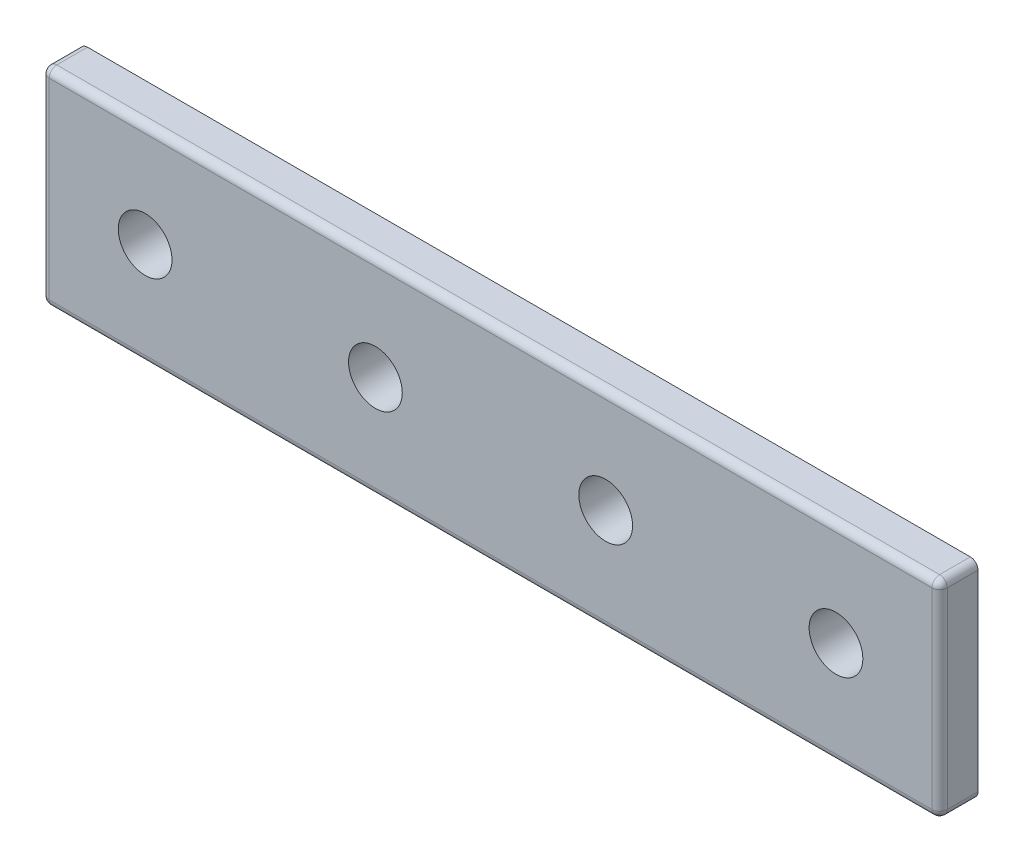
ISO-10303-21;
HEADER;
FILE_DESCRIPTION(('STEP AP214'),'2;1');
FILE_NAME('part.step','',(''),(''),'','','');
FILE_SCHEMA(('AUTOMOTIVE_DESIGN { 1 0 10303 214 1 1 1 1 }'));
ENDSEC;
DATA;
#1=APPLICATION_CONTEXT('core data for automotive mechanical design processes');
#2=APPLICATION_PROTOCOL_DEFINITION('international standard','automotive_design',2000,#1);
#3=PRODUCT_CONTEXT('',#1,'mechanical');
#4=PRODUCT('Part','Part','',(#3));
#5=PRODUCT_RELATED_PRODUCT_CATEGORY('part','',(#4));
#6=PRODUCT_DEFINITION_FORMATION('','',#4);
#7=PRODUCT_DEFINITION_CONTEXT('part definition',#1,'design');
#8=PRODUCT_DEFINITION('design','',#6,#7);
#9=PRODUCT_DEFINITION_SHAPE('','',#8);
#10=(LENGTH_UNIT() NAMED_UNIT(*) SI_UNIT(.MILLI.,.METRE.));
#11=(NAMED_UNIT(*) PLANE_ANGLE_UNIT() SI_UNIT($,.RADIAN.));
#12=(NAMED_UNIT(*) SI_UNIT($,.STERADIAN.) SOLID_ANGLE_UNIT());
#13=UNCERTAINTY_MEASURE_WITH_UNIT(LENGTH_MEASURE(1.E-05),#10,'distance_accuracy_value','');
#14=(GEOMETRIC_REPRESENTATION_CONTEXT(3) GLOBAL_UNCERTAINTY_ASSIGNED_CONTEXT((#13)) GLOBAL_UNIT_ASSIGNED_CONTEXT((#10,
#11,#12)) REPRESENTATION_CONTEXT('',''));
#15=CARTESIAN_POINT('',(0.,0.,0.));
#16=DIRECTION('',(0.,0.,1.));
#17=DIRECTION('',(1.,0.,0.));
#18=AXIS2_PLACEMENT_3D('',#15,#16,#17);
#19=CARTESIAN_POINT('',(0.,0.,2.5));
#20=DIRECTION('',(0.,0.,-1.));
#21=DIRECTION('',(-1.,0.,0.));
#22=AXIS2_PLACEMENT_3D('',#19,#20,#21);
#23=PLANE('',#22);
#24=DIRECTION('',(-1.,0.,0.));
#25=VECTOR('',#24,1.);
#26=CARTESIAN_POINT('',(0.,26.,2.5));
#27=LINE('',#26,#25);
#28=CARTESIAN_POINT('',(116.,26.,2.5));
#29=VERTEX_POINT('',#28);
#30=CARTESIAN_POINT('',(1.,26.,2.5));
#31=VERTEX_POINT('',#30);
#32=EDGE_CURVE('E160',#29,#31,#27,.T.);
#33=ORIENTED_EDGE('',*,*,#32,.T.);
#34=DIRECTION('',(0.,-1.,0.));
#35=VECTOR('',#34,1.);
#36=CARTESIAN_POINT('',(1.,0.,2.5));
#37=LINE('',#36,#35);
#38=CARTESIAN_POINT('',(1.,1.,2.5));
#39=VERTEX_POINT('',#38);
#40=EDGE_CURVE('E166',#31,#39,#37,.T.);
#41=ORIENTED_EDGE('',*,*,#40,.T.);
#42=DIRECTION('',(1.,0.,0.));
#43=VECTOR('',#42,1.);
#44=CARTESIAN_POINT('',(0.,1.,2.5));
#45=LINE('',#44,#43);
#46=CARTESIAN_POINT('',(116.,1.,2.5));
#47=VERTEX_POINT('',#46);
#48=EDGE_CURVE('E164',#39,#47,#45,.T.);
#49=ORIENTED_EDGE('',*,*,#48,.T.);
#50=DIRECTION('',(0.,1.,0.));
#51=VECTOR('',#50,1.);
#52=CARTESIAN_POINT('',(116.,0.,2.5));
#53=LINE('',#52,#51);
#54=EDGE_CURVE('E162',#47,#29,#53,.T.);
#55=ORIENTED_EDGE('',*,*,#54,.T.);
#56=EDGE_LOOP('',(#33,#41,#49,#55));
#57=FACE_BOUND('',#56,.T.);
#58=CARTESIAN_POINT('',(73.5,13.5,2.5));
#59=DIRECTION('',(0.,0.,1.));
#60=DIRECTION('',(1.,0.,0.));
#61=AXIS2_PLACEMENT_3D('',#58,#59,#60);
#62=CIRCLE('',#61,3.50000000000001);
#63=CARTESIAN_POINT('',(77.,13.5,2.5));
#64=VERTEX_POINT('',#63);
#65=EDGE_CURVE('E223',#64,#64,#62,.T.);
#66=ORIENTED_EDGE('',*,*,#65,.F.);
#67=EDGE_LOOP('',(#66));
#68=FACE_BOUND('',#67,.T.);
#69=CARTESIAN_POINT('',(13.5,13.5,2.5));
#70=DIRECTION('',(0.,0.,1.));
#71=DIRECTION('',(1.,0.,0.));
#72=AXIS2_PLACEMENT_3D('',#69,#70,#71);
#73=CIRCLE('',#72,3.5);
#74=CARTESIAN_POINT('',(17.,13.5,2.5));
#75=VERTEX_POINT('',#74);
#76=EDGE_CURVE('E136',#75,#75,#73,.T.);
#77=ORIENTED_EDGE('',*,*,#76,.F.);
#78=EDGE_LOOP('',(#77));
#79=FACE_BOUND('',#78,.T.);
#80=CARTESIAN_POINT('',(43.5,13.5,2.5));
#81=DIRECTION('',(0.,0.,1.));
#82=DIRECTION('',(1.,0.,0.));
#83=AXIS2_PLACEMENT_3D('',#80,#81,#82);
#84=CIRCLE('',#83,3.5);
#85=CARTESIAN_POINT('',(47.,13.5,2.5));
#86=VERTEX_POINT('',#85);
#87=EDGE_CURVE('E229',#86,#86,#84,.T.);
#88=ORIENTED_EDGE('',*,*,#87,.F.);
#89=EDGE_LOOP('',(#88));
#90=FACE_BOUND('',#89,.T.);
#91=CARTESIAN_POINT('',(103.5,13.5,2.5));
#92=DIRECTION('',(0.,0.,1.));
#93=DIRECTION('',(1.,0.,0.));
#94=AXIS2_PLACEMENT_3D('',#91,#92,#93);
#95=CIRCLE('',#94,3.50000000000001);
#96=CARTESIAN_POINT('',(107.,13.5,2.5));
#97=VERTEX_POINT('',#96);
#98=EDGE_CURVE('E215',#97,#97,#95,.T.);
#99=ORIENTED_EDGE('',*,*,#98,.F.);
#100=EDGE_LOOP('',(#99));
#101=FACE_BOUND('',#100,.T.);
#102=ADVANCED_FACE('F32',(#57,#68,#79,#90,#101),#23,.F.);
#103=CARTESIAN_POINT('',(0.,0.,-2.5));
#104=DIRECTION('',(0.,0.,-1.));
#105=DIRECTION('',(-1.,0.,0.));
#106=AXIS2_PLACEMENT_3D('',#103,#104,#105);
#107=PLANE('',#106);
#108=CARTESIAN_POINT('',(73.5,13.5,-2.5));
#109=DIRECTION('',(0.,0.,1.));
#110=DIRECTION('',(1.,0.,0.));
#111=AXIS2_PLACEMENT_3D('',#108,#109,#110);
#112=CIRCLE('',#111,3.50000000000001);
#113=CARTESIAN_POINT('',(77.,13.5,-2.5));
#114=VERTEX_POINT('',#113);
#115=EDGE_CURVE('E220',#114,#114,#112,.T.);
#116=ORIENTED_EDGE('',*,*,#115,.T.);
#117=EDGE_LOOP('',(#116));
#118=FACE_BOUND('',#117,.T.);
#119=CARTESIAN_POINT('',(13.5,13.5,-2.5));
#120=DIRECTION('',(0.,0.,1.));
#121=DIRECTION('',(1.,0.,0.));
#122=AXIS2_PLACEMENT_3D('',#119,#120,#121);
#123=CIRCLE('',#122,3.5);
#124=CARTESIAN_POINT('',(17.,13.5,-2.5));
#125=VERTEX_POINT('',#124);
#126=EDGE_CURVE('E142',#125,#125,#123,.T.);
#127=ORIENTED_EDGE('',*,*,#126,.T.);
#128=EDGE_LOOP('',(#127));
#129=FACE_BOUND('',#128,.T.);
#130=DIRECTION('',(1.,0.,0.));
#131=VECTOR('',#130,1.);
#132=CARTESIAN_POINT('',(117.,0.,-2.5));
#133=LINE('',#132,#131);
#134=CARTESIAN_POINT('',(1.,0.,-2.5));
#135=VERTEX_POINT('',#134);
#136=CARTESIAN_POINT('',(116.,0.,-2.5));
#137=VERTEX_POINT('',#136);
#138=EDGE_CURVE('E124',#135,#137,#133,.T.);
#139=ORIENTED_EDGE('',*,*,#138,.F.);
#140=CARTESIAN_POINT('',(1.,1.,-2.5));
#141=DIRECTION('',(0.,0.,-1.));
#142=DIRECTION('',(-1.,0.,0.));
#143=AXIS2_PLACEMENT_3D('',#140,#141,#142);
#144=CIRCLE('',#143,1.);
#145=CARTESIAN_POINT('',(0.,1.,-2.5));
#146=VERTEX_POINT('',#145);
#147=EDGE_CURVE('E108',#135,#146,#144,.T.);
#148=ORIENTED_EDGE('',*,*,#147,.T.);
#149=DIRECTION('',(0.,-1.,0.));
#150=VECTOR('',#149,1.);
#151=CARTESIAN_POINT('',(0.,0.,-2.5));
#152=LINE('',#151,#150);
#153=CARTESIAN_POINT('',(0.,26.,-2.5));
#154=VERTEX_POINT('',#153);
#155=EDGE_CURVE('E147',#154,#146,#152,.T.);
#156=ORIENTED_EDGE('',*,*,#155,.F.);
#157=CARTESIAN_POINT('',(1.,26.,-2.5));
#158=DIRECTION('',(0.,0.,-1.));
#159=DIRECTION('',(-1.,0.,0.));
#160=AXIS2_PLACEMENT_3D('',#157,#158,#159);
#161=CIRCLE('',#160,1.);
#162=CARTESIAN_POINT('',(1.,27.,-2.5));
#163=VERTEX_POINT('',#162);
#164=EDGE_CURVE('E129',#154,#163,#161,.T.);
#165=ORIENTED_EDGE('',*,*,#164,.T.);
#166=DIRECTION('',(-1.,0.,0.));
#167=VECTOR('',#166,1.);
#168=CARTESIAN_POINT('',(117.,27.,-2.5));
#169=LINE('',#168,#167);
#170=CARTESIAN_POINT('',(116.,27.,-2.5));
#171=VERTEX_POINT('',#170);
#172=EDGE_CURVE('E139',#171,#163,#169,.T.);
#173=ORIENTED_EDGE('',*,*,#172,.F.);
#174=CARTESIAN_POINT('',(116.,26.,-2.5));
#175=DIRECTION('',(0.,0.,-1.));
#176=DIRECTION('',(-1.,0.,0.));
#177=AXIS2_PLACEMENT_3D('',#174,#175,#176);
#178=CIRCLE('',#177,1.);
#179=CARTESIAN_POINT('',(117.,26.,-2.5));
#180=VERTEX_POINT('',#179);
#181=EDGE_CURVE('E153',#171,#180,#178,.T.);
#182=ORIENTED_EDGE('',*,*,#181,.T.);
#183=DIRECTION('',(0.,1.,0.));
#184=VECTOR('',#183,1.);
#185=CARTESIAN_POINT('',(117.,27.,-2.5));
#186=LINE('',#185,#184);
#187=CARTESIAN_POINT('',(117.,1.,-2.5));
#188=VERTEX_POINT('',#187);
#189=EDGE_CURVE('E135',#188,#180,#186,.T.);
#190=ORIENTED_EDGE('',*,*,#189,.F.);
#191=CARTESIAN_POINT('',(116.,1.,-2.5));
#192=DIRECTION('',(0.,0.,-1.));
#193=DIRECTION('',(-1.,0.,0.));
#194=AXIS2_PLACEMENT_3D('',#191,#192,#193);
#195=CIRCLE('',#194,1.);
#196=EDGE_CURVE('E119',#188,#137,#195,.T.);
#197=ORIENTED_EDGE('',*,*,#196,.T.);
#198=EDGE_LOOP('',(#139,#148,#156,#165,#173,#182,#190,#197));
#199=FACE_BOUND('',#198,.T.);
#200=CARTESIAN_POINT('',(43.5,13.5,-2.5));
#201=DIRECTION('',(0.,0.,1.));
#202=DIRECTION('',(1.,0.,0.));
#203=AXIS2_PLACEMENT_3D('',#200,#201,#202);
#204=CIRCLE('',#203,3.5);
#205=CARTESIAN_POINT('',(47.,13.5,-2.5));
#206=VERTEX_POINT('',#205);
#207=EDGE_CURVE('E226',#206,#206,#204,.T.);
#208=ORIENTED_EDGE('',*,*,#207,.T.);
#209=EDGE_LOOP('',(#208));
#210=FACE_BOUND('',#209,.T.);
#211=CARTESIAN_POINT('',(103.5,13.5,-2.5));
#212=DIRECTION('',(0.,0.,1.));
#213=DIRECTION('',(1.,0.,0.));
#214=AXIS2_PLACEMENT_3D('',#211,#212,#213);
#215=CIRCLE('',#214,3.50000000000001);
#216=CARTESIAN_POINT('',(107.,13.5,-2.5));
#217=VERTEX_POINT('',#216);
#218=EDGE_CURVE('E210',#217,#217,#215,.T.);
#219=ORIENTED_EDGE('',*,*,#218,.T.);
#220=EDGE_LOOP('',(#219));
#221=FACE_BOUND('',#220,.T.);
#222=ADVANCED_FACE('F131',(#118,#129,#199,#210,#221),#107,.T.);
#223=CARTESIAN_POINT('',(117.,0.,2.5));
#224=DIRECTION('',(0.,1.,0.));
#225=DIRECTION('',(-1.,0.,0.));
#226=AXIS2_PLACEMENT_3D('',#223,#224,#225);
#227=PLANE('',#226);
#228=DIRECTION('',(1.,0.,0.));
#229=VECTOR('',#228,1.);
#230=CARTESIAN_POINT('',(117.,0.,1.5));
#231=LINE('',#230,#229);
#232=CARTESIAN_POINT('',(116.,0.,1.5));
#233=VERTEX_POINT('',#232);
#234=CARTESIAN_POINT('',(1.,0.,1.5));
#235=VERTEX_POINT('',#234);
#236=EDGE_CURVE('E127',#233,#235,#231,.F.);
#237=ORIENTED_EDGE('',*,*,#236,.T.);
#238=DIRECTION('',(0.,0.,-1.));
#239=VECTOR('',#238,1.);
#240=CARTESIAN_POINT('',(1.,0.,2.5));
#241=LINE('',#240,#239);
#242=EDGE_CURVE('E112',#235,#135,#241,.T.);
#243=ORIENTED_EDGE('',*,*,#242,.T.);
#244=ORIENTED_EDGE('',*,*,#138,.T.);
#245=DIRECTION('',(0.,0.,-1.));
#246=VECTOR('',#245,1.);
#247=CARTESIAN_POINT('',(116.,0.,2.5));
#248=LINE('',#247,#246);
#249=EDGE_CURVE('E149',#137,#233,#248,.F.);
#250=ORIENTED_EDGE('',*,*,#249,.T.);
#251=EDGE_LOOP('',(#237,#243,#244,#250));
#252=FACE_BOUND('',#251,.T.);
#253=ADVANCED_FACE('F123',(#252),#227,.F.);
#254=CARTESIAN_POINT('',(117.,27.,2.5));
#255=DIRECTION('',(-1.,0.,0.));
#256=DIRECTION('',(0.,0.,1.));
#257=AXIS2_PLACEMENT_3D('',#254,#255,#256);
#258=PLANE('',#257);
#259=DIRECTION('',(0.,1.,0.));
#260=VECTOR('',#259,1.);
#261=CARTESIAN_POINT('',(117.,27.,1.5));
#262=LINE('',#261,#260);
#263=CARTESIAN_POINT('',(117.,26.,1.5));
#264=VERTEX_POINT('',#263);
#265=CARTESIAN_POINT('',(117.,1.,1.5));
#266=VERTEX_POINT('',#265);
#267=EDGE_CURVE('E171',#264,#266,#262,.F.);
#268=ORIENTED_EDGE('',*,*,#267,.T.);
#269=DIRECTION('',(0.,0.,-1.));
#270=VECTOR('',#269,1.);
#271=CARTESIAN_POINT('',(117.,1.,2.5));
#272=LINE('',#271,#270);
#273=EDGE_CURVE('E173',#266,#188,#272,.T.);
#274=ORIENTED_EDGE('',*,*,#273,.T.);
#275=ORIENTED_EDGE('',*,*,#189,.T.);
#276=DIRECTION('',(0.,0.,-1.));
#277=VECTOR('',#276,1.);
#278=CARTESIAN_POINT('',(117.,26.,2.5));
#279=LINE('',#278,#277);
#280=EDGE_CURVE('E169',#180,#264,#279,.F.);
#281=ORIENTED_EDGE('',*,*,#280,.T.);
#282=EDGE_LOOP('',(#268,#274,#275,#281));
#283=FACE_BOUND('',#282,.T.);
#284=ADVANCED_FACE('F267',(#283),#258,.F.);
#285=CARTESIAN_POINT('',(117.,27.,2.5));
#286=DIRECTION('',(0.,-1.,0.));
#287=DIRECTION('',(1.,0.,0.));
#288=AXIS2_PLACEMENT_3D('',#285,#286,#287);
#289=PLANE('',#288);
#290=DIRECTION('',(-1.,0.,0.));
#291=VECTOR('',#290,1.);
#292=CARTESIAN_POINT('',(117.,27.,1.5));
#293=LINE('',#292,#291);
#294=CARTESIAN_POINT('',(1.,27.,1.5));
#295=VERTEX_POINT('',#294);
#296=CARTESIAN_POINT('',(116.,27.,1.5));
#297=VERTEX_POINT('',#296);
#298=EDGE_CURVE('E41',#295,#297,#293,.F.);
#299=ORIENTED_EDGE('',*,*,#298,.T.);
#300=DIRECTION('',(0.,0.,-1.));
#301=VECTOR('',#300,1.);
#302=CARTESIAN_POINT('',(116.,27.,2.5));
#303=LINE('',#302,#301);
#304=EDGE_CURVE('E11',#297,#171,#303,.T.);
#305=ORIENTED_EDGE('',*,*,#304,.T.);
#306=ORIENTED_EDGE('',*,*,#172,.T.);
#307=DIRECTION('',(0.,0.,-1.));
#308=VECTOR('',#307,1.);
#309=CARTESIAN_POINT('',(1.,27.,2.5));
#310=LINE('',#309,#308);
#311=EDGE_CURVE('E52',#163,#295,#310,.F.);
#312=ORIENTED_EDGE('',*,*,#311,.T.);
#313=EDGE_LOOP('',(#299,#305,#306,#312));
#314=FACE_BOUND('',#313,.T.);
#315=ADVANCED_FACE('F263',(#314),#289,.F.);
#316=CARTESIAN_POINT('',(0.,0.,2.5));
#317=DIRECTION('',(1.,0.,0.));
#318=DIRECTION('',(0.,0.,-1.));
#319=AXIS2_PLACEMENT_3D('',#316,#317,#318);
#320=PLANE('',#319);
#321=ORIENTED_EDGE('',*,*,#155,.T.);
#322=DIRECTION('',(0.,0.,-1.));
#323=VECTOR('',#322,1.);
#324=CARTESIAN_POINT('',(0.,1.,2.5));
#325=LINE('',#324,#323);
#326=CARTESIAN_POINT('',(0.,1.,1.5));
#327=VERTEX_POINT('',#326);
#328=EDGE_CURVE('E113',#146,#327,#325,.F.);
#329=ORIENTED_EDGE('',*,*,#328,.T.);
#330=DIRECTION('',(0.,-1.,0.));
#331=VECTOR('',#330,1.);
#332=CARTESIAN_POINT('',(0.,0.,1.5));
#333=LINE('',#332,#331);
#334=CARTESIAN_POINT('',(0.,26.,1.5));
#335=VERTEX_POINT('',#334);
#336=EDGE_CURVE('E157',#327,#335,#333,.F.);
#337=ORIENTED_EDGE('',*,*,#336,.T.);
#338=DIRECTION('',(0.,0.,-1.));
#339=VECTOR('',#338,1.);
#340=CARTESIAN_POINT('',(0.,26.,2.5));
#341=LINE('',#340,#339);
#342=EDGE_CURVE('E118',#335,#154,#341,.T.);
#343=ORIENTED_EDGE('',*,*,#342,.T.);
#344=EDGE_LOOP('',(#321,#329,#337,#343));
#345=FACE_BOUND('',#344,.T.);
#346=ADVANCED_FACE('F248',(#345),#320,.F.);
#347=CARTESIAN_POINT('',(13.5,13.5,2.5));
#348=DIRECTION('',(0.,0.,-1.));
#349=DIRECTION('',(-1.,0.,0.));
#350=AXIS2_PLACEMENT_3D('',#347,#348,#349);
#351=CYLINDRICAL_SURFACE('',#350,3.5);
#352=ORIENTED_EDGE('',*,*,#76,.T.);
#353=EDGE_LOOP('',(#352));
#354=FACE_BOUND('',#353,.T.);
#355=ORIENTED_EDGE('',*,*,#126,.F.);
#356=EDGE_LOOP('',(#355));
#357=FACE_BOUND('',#356,.T.);
#358=ADVANCED_FACE('F238',(#354,#357),#351,.F.);
#359=CARTESIAN_POINT('',(43.5,13.5,2.5));
#360=DIRECTION('',(0.,0.,-1.));
#361=DIRECTION('',(-1.,0.,0.));
#362=AXIS2_PLACEMENT_3D('',#359,#360,#361);
#363=CYLINDRICAL_SURFACE('',#362,3.5);
#364=ORIENTED_EDGE('',*,*,#87,.T.);
#365=EDGE_LOOP('',(#364));
#366=FACE_BOUND('',#365,.T.);
#367=ORIENTED_EDGE('',*,*,#207,.F.);
#368=EDGE_LOOP('',(#367));
#369=FACE_BOUND('',#368,.T.);
#370=ADVANCED_FACE('F235',(#366,#369),#363,.F.);
#371=CARTESIAN_POINT('',(73.5,13.5,2.5));
#372=DIRECTION('',(0.,0.,-1.));
#373=DIRECTION('',(-1.,0.,0.));
#374=AXIS2_PLACEMENT_3D('',#371,#372,#373);
#375=CYLINDRICAL_SURFACE('',#374,3.50000000000001);
#376=ORIENTED_EDGE('',*,*,#65,.T.);
#377=EDGE_LOOP('',(#376));
#378=FACE_BOUND('',#377,.T.);
#379=ORIENTED_EDGE('',*,*,#115,.F.);
#380=EDGE_LOOP('',(#379));
#381=FACE_BOUND('',#380,.T.);
#382=ADVANCED_FACE('F237',(#378,#381),#375,.F.);
#383=CARTESIAN_POINT('',(103.5,13.5,2.5));
#384=DIRECTION('',(0.,0.,-1.));
#385=DIRECTION('',(-1.,0.,0.));
#386=AXIS2_PLACEMENT_3D('',#383,#384,#385);
#387=CYLINDRICAL_SURFACE('',#386,3.50000000000001);
#388=ORIENTED_EDGE('',*,*,#98,.T.);
#389=EDGE_LOOP('',(#388));
#390=FACE_BOUND('',#389,.T.);
#391=ORIENTED_EDGE('',*,*,#218,.F.);
#392=EDGE_LOOP('',(#391));
#393=FACE_BOUND('',#392,.T.);
#394=ADVANCED_FACE('F245',(#390,#393),#387,.F.);
#395=CARTESIAN_POINT('',(116.,26.,2.5));
#396=DIRECTION('',(0.,0.,-1.));
#397=DIRECTION('',(-1.,0.,0.));
#398=AXIS2_PLACEMENT_3D('',#395,#396,#397);
#399=CYLINDRICAL_SURFACE('',#398,1.);
#400=CARTESIAN_POINT('',(116.,26.,1.5));
#401=DIRECTION('',(0.,0.,1.));
#402=DIRECTION('',(1.,0.,0.));
#403=AXIS2_PLACEMENT_3D('',#400,#401,#402);
#404=CIRCLE('',#403,1.);
#405=EDGE_CURVE('E36',#264,#297,#404,.T.);
#406=ORIENTED_EDGE('',*,*,#405,.F.);
#407=ORIENTED_EDGE('',*,*,#280,.F.);
#408=ORIENTED_EDGE('',*,*,#181,.F.);
#409=ORIENTED_EDGE('',*,*,#304,.F.);
#410=EDGE_LOOP('',(#406,#407,#408,#409));
#411=FACE_BOUND('',#410,.T.);
#412=ADVANCED_FACE('F34',(#411),#399,.T.);
#413=CARTESIAN_POINT('',(116.,26.,1.5));
#414=DIRECTION('',(0.,0.,1.));
#415=DIRECTION('',(1.,0.,0.));
#416=AXIS2_PLACEMENT_3D('',#413,#414,#415);
#417=SPHERICAL_SURFACE('',#416,1.);
#418=CARTESIAN_POINT('',(116.,26.,1.5));
#419=DIRECTION('',(0.,1.,0.));
#420=DIRECTION('',(0.,0.,1.));
#421=AXIS2_PLACEMENT_3D('',#418,#419,#420);
#422=CIRCLE('',#421,1.);
#423=EDGE_CURVE('E202',#264,#29,#422,.F.);
#424=ORIENTED_EDGE('',*,*,#423,.F.);
#425=ORIENTED_EDGE('',*,*,#405,.T.);
#426=CARTESIAN_POINT('',(116.,26.,1.5));
#427=DIRECTION('',(1.,0.,0.));
#428=DIRECTION('',(0.,0.,-1.));
#429=AXIS2_PLACEMENT_3D('',#426,#427,#428);
#430=CIRCLE('',#429,1.);
#431=EDGE_CURVE('E204',#29,#297,#430,.F.);
#432=ORIENTED_EDGE('',*,*,#431,.F.);
#433=EDGE_LOOP('',(#424,#425,#432));
#434=FACE_BOUND('',#433,.T.);
#435=ADVANCED_FACE('F308',(#434),#417,.T.);
#436=CARTESIAN_POINT('',(1.,26.,2.5));
#437=DIRECTION('',(0.,0.,-1.));
#438=DIRECTION('',(-1.,0.,0.));
#439=AXIS2_PLACEMENT_3D('',#436,#437,#438);
#440=CYLINDRICAL_SURFACE('',#439,1.);
#441=ORIENTED_EDGE('',*,*,#164,.F.);
#442=ORIENTED_EDGE('',*,*,#342,.F.);
#443=CARTESIAN_POINT('',(1.,26.,1.5));
#444=DIRECTION('',(0.,0.,1.));
#445=DIRECTION('',(1.,0.,0.));
#446=AXIS2_PLACEMENT_3D('',#443,#444,#445);
#447=CIRCLE('',#446,1.);
#448=EDGE_CURVE('E199',#295,#335,#447,.T.);
#449=ORIENTED_EDGE('',*,*,#448,.F.);
#450=ORIENTED_EDGE('',*,*,#311,.F.);
#451=EDGE_LOOP('',(#441,#442,#449,#450));
#452=FACE_BOUND('',#451,.T.);
#453=ADVANCED_FACE('F306',(#452),#440,.T.);
#454=CARTESIAN_POINT('',(0.,26.,1.5));
#455=DIRECTION('',(-1.,0.,0.));
#456=DIRECTION('',(0.,-1.,0.));
#457=AXIS2_PLACEMENT_3D('',#454,#455,#456);
#458=CYLINDRICAL_SURFACE('',#457,1.);
#459=ORIENTED_EDGE('',*,*,#431,.T.);
#460=ORIENTED_EDGE('',*,*,#298,.F.);
#461=CARTESIAN_POINT('',(1.,26.,1.5));
#462=DIRECTION('',(-1.,0.,0.));
#463=DIRECTION('',(0.,-1.,0.));
#464=AXIS2_PLACEMENT_3D('',#461,#462,#463);
#465=CIRCLE('',#464,1.);
#466=EDGE_CURVE('E196',#31,#295,#465,.T.);
#467=ORIENTED_EDGE('',*,*,#466,.F.);
#468=ORIENTED_EDGE('',*,*,#32,.F.);
#469=EDGE_LOOP('',(#459,#460,#467,#468));
#470=FACE_BOUND('',#469,.T.);
#471=ADVANCED_FACE('F302',(#470),#458,.T.);
#472=CARTESIAN_POINT('',(116.,0.,1.5));
#473=DIRECTION('',(0.,1.,0.));
#474=DIRECTION('',(0.,0.,1.));
#475=AXIS2_PLACEMENT_3D('',#472,#473,#474);
#476=CYLINDRICAL_SURFACE('',#475,1.);
#477=ORIENTED_EDGE('',*,*,#423,.T.);
#478=ORIENTED_EDGE('',*,*,#54,.F.);
#479=CARTESIAN_POINT('',(116.,1.,1.5));
#480=DIRECTION('',(0.,-1.,0.));
#481=DIRECTION('',(0.,0.,-1.));
#482=AXIS2_PLACEMENT_3D('',#479,#480,#481);
#483=CIRCLE('',#482,1.);
#484=EDGE_CURVE('E193',#266,#47,#483,.T.);
#485=ORIENTED_EDGE('',*,*,#484,.F.);
#486=ORIENTED_EDGE('',*,*,#267,.F.);
#487=EDGE_LOOP('',(#477,#478,#485,#486));
#488=FACE_BOUND('',#487,.T.);
#489=ADVANCED_FACE('F298',(#488),#476,.T.);
#490=CARTESIAN_POINT('',(116.,1.,2.5));
#491=DIRECTION('',(0.,0.,-1.));
#492=DIRECTION('',(-1.,0.,0.));
#493=AXIS2_PLACEMENT_3D('',#490,#491,#492);
#494=CYLINDRICAL_SURFACE('',#493,1.);
#495=ORIENTED_EDGE('',*,*,#196,.F.);
#496=ORIENTED_EDGE('',*,*,#273,.F.);
#497=CARTESIAN_POINT('',(116.,1.,1.5));
#498=DIRECTION('',(0.,0.,1.));
#499=DIRECTION('',(1.,0.,0.));
#500=AXIS2_PLACEMENT_3D('',#497,#498,#499);
#501=CIRCLE('',#500,1.);
#502=EDGE_CURVE('E190',#233,#266,#501,.T.);
#503=ORIENTED_EDGE('',*,*,#502,.F.);
#504=ORIENTED_EDGE('',*,*,#249,.F.);
#505=EDGE_LOOP('',(#495,#496,#503,#504));
#506=FACE_BOUND('',#505,.T.);
#507=ADVANCED_FACE('F294',(#506),#494,.T.);
#508=CARTESIAN_POINT('',(1.,26.,1.5));
#509=DIRECTION('',(0.,0.,1.));
#510=DIRECTION('',(1.,0.,0.));
#511=AXIS2_PLACEMENT_3D('',#508,#509,#510);
#512=SPHERICAL_SURFACE('',#511,1.);
#513=ORIENTED_EDGE('',*,*,#466,.T.);
#514=ORIENTED_EDGE('',*,*,#448,.T.);
#515=CARTESIAN_POINT('',(1.,26.,1.5));
#516=DIRECTION('',(0.,1.,0.));
#517=DIRECTION('',(0.,0.,1.));
#518=AXIS2_PLACEMENT_3D('',#515,#516,#517);
#519=CIRCLE('',#518,1.);
#520=EDGE_CURVE('E187',#31,#335,#519,.F.);
#521=ORIENTED_EDGE('',*,*,#520,.F.);
#522=EDGE_LOOP('',(#513,#514,#521));
#523=FACE_BOUND('',#522,.T.);
#524=ADVANCED_FACE('F290',(#523),#512,.T.);
#525=CARTESIAN_POINT('',(116.,1.,1.5));
#526=DIRECTION('',(0.,0.,1.));
#527=DIRECTION('',(1.,0.,0.));
#528=AXIS2_PLACEMENT_3D('',#525,#526,#527);
#529=SPHERICAL_SURFACE('',#528,1.);
#530=ORIENTED_EDGE('',*,*,#502,.T.);
#531=ORIENTED_EDGE('',*,*,#484,.T.);
#532=CARTESIAN_POINT('',(116.,1.,1.5));
#533=DIRECTION('',(1.,0.,0.));
#534=DIRECTION('',(0.,0.,-1.));
#535=AXIS2_PLACEMENT_3D('',#532,#533,#534);
#536=CIRCLE('',#535,1.);
#537=EDGE_CURVE('E184',#233,#47,#536,.F.);
#538=ORIENTED_EDGE('',*,*,#537,.F.);
#539=EDGE_LOOP('',(#530,#531,#538));
#540=FACE_BOUND('',#539,.T.);
#541=ADVANCED_FACE('F286',(#540),#529,.T.);
#542=CARTESIAN_POINT('',(1.,0.,1.5));
#543=DIRECTION('',(0.,-1.,0.));
#544=DIRECTION('',(0.,0.,-1.));
#545=AXIS2_PLACEMENT_3D('',#542,#543,#544);
#546=CYLINDRICAL_SURFACE('',#545,1.);
#547=ORIENTED_EDGE('',*,*,#520,.T.);
#548=ORIENTED_EDGE('',*,*,#336,.F.);
#549=CARTESIAN_POINT('',(1.,1.,1.5));
#550=DIRECTION('',(0.,-1.,0.));
#551=DIRECTION('',(0.,0.,-1.));
#552=AXIS2_PLACEMENT_3D('',#549,#550,#551);
#553=CIRCLE('',#552,1.);
#554=EDGE_CURVE('E181',#39,#327,#553,.T.);
#555=ORIENTED_EDGE('',*,*,#554,.F.);
#556=ORIENTED_EDGE('',*,*,#40,.F.);
#557=EDGE_LOOP('',(#547,#548,#555,#556));
#558=FACE_BOUND('',#557,.T.);
#559=ADVANCED_FACE('F282',(#558),#546,.T.);
#560=CARTESIAN_POINT('',(0.,1.,1.5));
#561=DIRECTION('',(1.,0.,0.));
#562=DIRECTION('',(0.,1.,0.));
#563=AXIS2_PLACEMENT_3D('',#560,#561,#562);
#564=CYLINDRICAL_SURFACE('',#563,1.);
#565=ORIENTED_EDGE('',*,*,#537,.T.);
#566=ORIENTED_EDGE('',*,*,#48,.F.);
#567=CARTESIAN_POINT('',(1.,1.,1.5));
#568=DIRECTION('',(-1.,0.,0.));
#569=DIRECTION('',(0.,0.,1.));
#570=AXIS2_PLACEMENT_3D('',#567,#568,#569);
#571=CIRCLE('',#570,1.);
#572=EDGE_CURVE('E179',#235,#39,#571,.T.);
#573=ORIENTED_EDGE('',*,*,#572,.F.);
#574=ORIENTED_EDGE('',*,*,#236,.F.);
#575=EDGE_LOOP('',(#565,#566,#573,#574));
#576=FACE_BOUND('',#575,.T.);
#577=ADVANCED_FACE('F278',(#576),#564,.T.);
#578=CARTESIAN_POINT('',(1.,1.,1.5));
#579=DIRECTION('',(0.,0.,1.));
#580=DIRECTION('',(1.,0.,0.));
#581=AXIS2_PLACEMENT_3D('',#578,#579,#580);
#582=SPHERICAL_SURFACE('',#581,1.);
#583=ORIENTED_EDGE('',*,*,#572,.T.);
#584=ORIENTED_EDGE('',*,*,#554,.T.);
#585=CARTESIAN_POINT('',(1.,1.,1.5));
#586=DIRECTION('',(0.,0.,1.));
#587=DIRECTION('',(1.,0.,0.));
#588=AXIS2_PLACEMENT_3D('',#585,#586,#587);
#589=CIRCLE('',#588,1.);
#590=EDGE_CURVE('E177',#235,#327,#589,.F.);
#591=ORIENTED_EDGE('',*,*,#590,.F.);
#592=EDGE_LOOP('',(#583,#584,#591));
#593=FACE_BOUND('',#592,.T.);
#594=ADVANCED_FACE('F275',(#593),#582,.T.);
#595=CARTESIAN_POINT('',(1.,1.,2.5));
#596=DIRECTION('',(0.,0.,-1.));
#597=DIRECTION('',(-1.,0.,0.));
#598=AXIS2_PLACEMENT_3D('',#595,#596,#597);
#599=CYLINDRICAL_SURFACE('',#598,1.);
#600=ORIENTED_EDGE('',*,*,#590,.T.);
#601=ORIENTED_EDGE('',*,*,#328,.F.);
#602=ORIENTED_EDGE('',*,*,#147,.F.);
#603=ORIENTED_EDGE('',*,*,#242,.F.);
#604=EDGE_LOOP('',(#600,#601,#602,#603));
#605=FACE_BOUND('',#604,.T.);
#606=ADVANCED_FACE('F111',(#605),#599,.T.);
#607=CLOSED_SHELL('',(#102,#222,#253,#284,#315,#346,#358,#370,#382,#394,#412,#435,#453,#471,
#489,#507,#524,#541,#559,#577,#594,#606));
#608=MANIFOLD_SOLID_BREP('B2',#607);
#609=ADVANCED_BREP_SHAPE_REPRESENTATION('',(#18,#608),#14);
#610=SHAPE_DEFINITION_REPRESENTATION(#9,#609);
ENDSEC;
END-ISO-10303-21;
